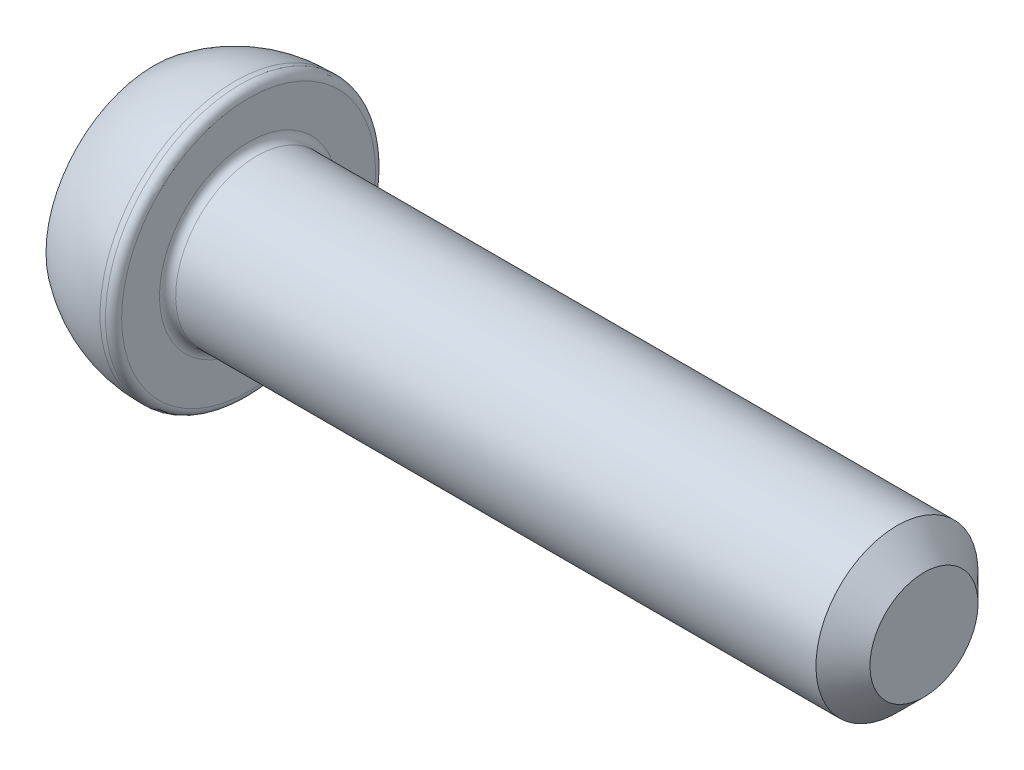
ISO-10303-21;
HEADER;
FILE_DESCRIPTION(('STEP AP214'),'2;1');
FILE_NAME('part.step','',(''),(''),'','','');
FILE_SCHEMA(('AUTOMOTIVE_DESIGN { 1 0 10303 214 1 1 1 1 }'));
ENDSEC;
DATA;
#1=APPLICATION_CONTEXT('core data for automotive mechanical design processes');
#2=APPLICATION_PROTOCOL_DEFINITION('international standard','automotive_design',2000,#1);
#3=PRODUCT_CONTEXT('',#1,'mechanical');
#4=PRODUCT('Part','Part','',(#3));
#5=PRODUCT_RELATED_PRODUCT_CATEGORY('part','',(#4));
#6=PRODUCT_DEFINITION_FORMATION('','',#4);
#7=PRODUCT_DEFINITION_CONTEXT('part definition',#1,'design');
#8=PRODUCT_DEFINITION('design','',#6,#7);
#9=PRODUCT_DEFINITION_SHAPE('','',#8);
#10=(LENGTH_UNIT() NAMED_UNIT(*) SI_UNIT(.MILLI.,.METRE.));
#11=(NAMED_UNIT(*) PLANE_ANGLE_UNIT() SI_UNIT($,.RADIAN.));
#12=(NAMED_UNIT(*) SI_UNIT($,.STERADIAN.) SOLID_ANGLE_UNIT());
#13=UNCERTAINTY_MEASURE_WITH_UNIT(LENGTH_MEASURE(1.E-05),#10,'distance_accuracy_value','');
#14=(GEOMETRIC_REPRESENTATION_CONTEXT(3) GLOBAL_UNCERTAINTY_ASSIGNED_CONTEXT((#13)) GLOBAL_UNIT_ASSIGNED_CONTEXT((#10,
#11,#12)) REPRESENTATION_CONTEXT('',''));
#15=CARTESIAN_POINT('',(0.,0.,0.));
#16=DIRECTION('',(0.,0.,1.));
#17=DIRECTION('',(1.,0.,0.));
#18=AXIS2_PLACEMENT_3D('',#15,#16,#17);
#19=CARTESIAN_POINT('',(0.,0.,0.));
#20=DIRECTION('',(-1.,0.,0.));
#21=DIRECTION('',(0.,-1.,0.));
#22=AXIS2_PLACEMENT_3D('',#19,#20,#21);
#23=PLANE('',#22);
#24=DIRECTION('',(0.,0.866025403784438,-0.5));
#25=VECTOR('',#24,1.);
#26=CARTESIAN_POINT('',(0.,0.,2.3094010767585));
#27=LINE('',#26,#25);
#28=CARTESIAN_POINT('',(0.,0.,2.3094010767585));
#29=VERTEX_POINT('',#28);
#30=CARTESIAN_POINT('',(0.,2.,1.15470053837925));
#31=VERTEX_POINT('',#30);
#32=EDGE_CURVE('E54',#29,#31,#27,.T.);
#33=ORIENTED_EDGE('',*,*,#32,.F.);
#34=DIRECTION('',(0.,0.866025403784439,0.5));
#35=VECTOR('',#34,1.);
#36=CARTESIAN_POINT('',(0.,-2.,1.15470053837925));
#37=LINE('',#36,#35);
#38=CARTESIAN_POINT('',(0.,-2.,1.15470053837925));
#39=VERTEX_POINT('',#38);
#40=EDGE_CURVE('E137',#39,#29,#37,.T.);
#41=ORIENTED_EDGE('',*,*,#40,.F.);
#42=DIRECTION('',(0.,0.,1.));
#43=VECTOR('',#42,1.);
#44=CARTESIAN_POINT('',(0.,-2.,-1.15470053837925));
#45=LINE('',#44,#43);
#46=CARTESIAN_POINT('',(0.,-2.,-1.15470053837925));
#47=VERTEX_POINT('',#46);
#48=EDGE_CURVE('E135',#47,#39,#45,.T.);
#49=ORIENTED_EDGE('',*,*,#48,.F.);
#50=DIRECTION('',(0.,-0.866025403784439,0.5));
#51=VECTOR('',#50,1.);
#52=CARTESIAN_POINT('',(0.,0.,-2.3094010767585));
#53=LINE('',#52,#51);
#54=CARTESIAN_POINT('',(0.,0.,-2.3094010767585));
#55=VERTEX_POINT('',#54);
#56=EDGE_CURVE('E102',#55,#47,#53,.T.);
#57=ORIENTED_EDGE('',*,*,#56,.F.);
#58=DIRECTION('',(0.,-0.866025403784439,-0.5));
#59=VECTOR('',#58,1.);
#60=CARTESIAN_POINT('',(0.,2.,-1.15470053837925));
#61=LINE('',#60,#59);
#62=CARTESIAN_POINT('',(0.,2.,-1.15470053837925));
#63=VERTEX_POINT('',#62);
#64=EDGE_CURVE('E131',#63,#55,#61,.T.);
#65=ORIENTED_EDGE('',*,*,#64,.F.);
#66=DIRECTION('',(0.,0.,-1.));
#67=VECTOR('',#66,1.);
#68=CARTESIAN_POINT('',(0.,2.,1.15470053837925));
#69=LINE('',#68,#67);
#70=EDGE_CURVE('E128',#31,#63,#69,.T.);
#71=ORIENTED_EDGE('',*,*,#70,.F.);
#72=EDGE_LOOP('',(#33,#41,#49,#57,#65,#71));
#73=FACE_BOUND('',#72,.T.);
#74=CARTESIAN_POINT('',(0.,0.,0.));
#75=DIRECTION('',(1.,0.,0.));
#76=DIRECTION('',(0.,1.,0.));
#77=AXIS2_PLACEMENT_3D('',#74,#75,#76);
#78=CIRCLE('',#77,4.);
#79=CARTESIAN_POINT('',(0.,4.,0.));
#80=VERTEX_POINT('',#79);
#81=EDGE_CURVE('E149',#80,#80,#78,.T.);
#82=ORIENTED_EDGE('',*,*,#81,.F.);
#83=EDGE_LOOP('',(#82));
#84=FACE_BOUND('',#83,.T.);
#85=ADVANCED_FACE('F38',(#73,#84),#23,.T.);
#86=CARTESIAN_POINT('',(3.,0.,0.));
#87=DIRECTION('',(1.,0.,0.));
#88=DIRECTION('',(0.,1.,0.));
#89=AXIS2_PLACEMENT_3D('',#86,#87,#88);
#90=SPHERICAL_SURFACE('',#89,5.);
#91=ORIENTED_EDGE('',*,*,#81,.T.);
#92=EDGE_LOOP('',(#91));
#93=FACE_BOUND('',#92,.T.);
#94=CARTESIAN_POINT('',(3.,0.,0.));
#95=DIRECTION('',(1.,0.,0.));
#96=DIRECTION('',(0.,1.,0.));
#97=AXIS2_PLACEMENT_3D('',#94,#95,#96);
#98=CIRCLE('',#97,5.);
#99=CARTESIAN_POINT('',(3.,5.,0.));
#100=VERTEX_POINT('',#99);
#101=EDGE_CURVE('E141',#100,#100,#98,.T.);
#102=ORIENTED_EDGE('',*,*,#101,.F.);
#103=EDGE_LOOP('',(#102));
#104=FACE_BOUND('',#103,.T.);
#105=ADVANCED_FACE('F178',(#93,#104),#90,.T.);
#106=CARTESIAN_POINT('',(28.5,0.,0.));
#107=DIRECTION('',(1.,0.,0.));
#108=DIRECTION('',(0.,1.,0.));
#109=AXIS2_PLACEMENT_3D('',#106,#107,#108);
#110=CYLINDRICAL_SURFACE('',#109,5.);
#111=CARTESIAN_POINT('',(3.2,0.,0.));
#112=DIRECTION('',(1.,0.,0.));
#113=DIRECTION('',(0.,1.,0.));
#114=AXIS2_PLACEMENT_3D('',#111,#112,#113);
#115=CIRCLE('',#114,5.);
#116=CARTESIAN_POINT('',(3.2,5.,0.));
#117=VERTEX_POINT('',#116);
#118=EDGE_CURVE('E161',#117,#117,#115,.F.);
#119=ORIENTED_EDGE('',*,*,#118,.T.);
#120=EDGE_LOOP('',(#119));
#121=FACE_BOUND('',#120,.T.);
#122=ORIENTED_EDGE('',*,*,#101,.T.);
#123=EDGE_LOOP('',(#122));
#124=FACE_BOUND('',#123,.T.);
#125=ADVANCED_FACE('F184',(#121,#124),#110,.T.);
#126=CARTESIAN_POINT('',(3.5,5.,0.));
#127=DIRECTION('',(1.,0.,0.));
#128=DIRECTION('',(0.,1.,0.));
#129=AXIS2_PLACEMENT_3D('',#126,#127,#128);
#130=PLANE('',#129);
#131=CARTESIAN_POINT('',(3.5,0.,0.));
#132=DIRECTION('',(1.,0.,0.));
#133=DIRECTION('',(0.,1.,0.));
#134=AXIS2_PLACEMENT_3D('',#131,#132,#133);
#135=CIRCLE('',#134,3.3);
#136=CARTESIAN_POINT('',(3.5,3.3,0.));
#137=VERTEX_POINT('',#136);
#138=EDGE_CURVE('E158',#137,#137,#135,.F.);
#139=ORIENTED_EDGE('',*,*,#138,.T.);
#140=EDGE_LOOP('',(#139));
#141=FACE_BOUND('',#140,.T.);
#142=CARTESIAN_POINT('',(3.5,0.,0.));
#143=DIRECTION('',(1.,0.,0.));
#144=DIRECTION('',(0.,1.,0.));
#145=AXIS2_PLACEMENT_3D('',#142,#143,#144);
#146=CIRCLE('',#145,4.7);
#147=CARTESIAN_POINT('',(3.5,4.7,0.));
#148=VERTEX_POINT('',#147);
#149=EDGE_CURVE('E155',#148,#148,#146,.T.);
#150=ORIENTED_EDGE('',*,*,#149,.T.);
#151=EDGE_LOOP('',(#150));
#152=FACE_BOUND('',#151,.T.);
#153=ADVANCED_FACE('F203',(#141,#152),#130,.T.);
#154=CARTESIAN_POINT('',(28.5,0.,0.));
#155=DIRECTION('',(1.,0.,0.));
#156=DIRECTION('',(0.,1.,0.));
#157=AXIS2_PLACEMENT_3D('',#154,#155,#156);
#158=CYLINDRICAL_SURFACE('',#157,3.);
#159=CARTESIAN_POINT('',(27.5,0.,0.));
#160=DIRECTION('',(1.,0.,0.));
#161=DIRECTION('',(0.,1.,0.));
#162=AXIS2_PLACEMENT_3D('',#159,#160,#161);
#163=CIRCLE('',#162,3.);
#164=CARTESIAN_POINT('',(27.5,3.,0.));
#165=VERTEX_POINT('',#164);
#166=EDGE_CURVE('E11',#165,#165,#163,.F.);
#167=ORIENTED_EDGE('',*,*,#166,.T.);
#168=EDGE_LOOP('',(#167));
#169=FACE_BOUND('',#168,.T.);
#170=CARTESIAN_POINT('',(3.8,0.,0.));
#171=DIRECTION('',(1.,0.,0.));
#172=DIRECTION('',(0.,1.,0.));
#173=AXIS2_PLACEMENT_3D('',#170,#171,#172);
#174=CIRCLE('',#173,3.);
#175=CARTESIAN_POINT('',(3.8,3.,0.));
#176=VERTEX_POINT('',#175);
#177=EDGE_CURVE('E152',#176,#176,#174,.T.);
#178=ORIENTED_EDGE('',*,*,#177,.T.);
#179=EDGE_LOOP('',(#178));
#180=FACE_BOUND('',#179,.T.);
#181=ADVANCED_FACE('F201',(#169,#180),#158,.T.);
#182=CARTESIAN_POINT('',(28.5,3.,0.));
#183=DIRECTION('',(1.,0.,0.));
#184=DIRECTION('',(0.,1.,0.));
#185=AXIS2_PLACEMENT_3D('',#182,#183,#184);
#186=PLANE('',#185);
#187=CARTESIAN_POINT('',(28.5,0.,0.));
#188=DIRECTION('',(1.,0.,0.));
#189=DIRECTION('',(0.,1.,0.));
#190=AXIS2_PLACEMENT_3D('',#187,#188,#189);
#191=CIRCLE('',#190,1.99999999999999);
#192=CARTESIAN_POINT('',(28.5,2.,0.));
#193=VERTEX_POINT('',#192);
#194=EDGE_CURVE('E47',#193,#193,#191,.T.);
#195=ORIENTED_EDGE('',*,*,#194,.T.);
#196=EDGE_LOOP('',(#195));
#197=FACE_BOUND('',#196,.T.);
#198=ADVANCED_FACE('F166',(#197),#186,.T.);
#199=CARTESIAN_POINT('',(2.,0.,2.3094010767585));
#200=DIRECTION('',(0.,0.5,0.866025403784439));
#201=DIRECTION('',(0.,-0.866025403784438,0.5));
#202=AXIS2_PLACEMENT_3D('',#199,#200,#201);
#203=PLANE('',#202);
#204=ORIENTED_EDGE('',*,*,#32,.T.);
#205=DIRECTION('',(-1.,0.,0.));
#206=VECTOR('',#205,1.);
#207=CARTESIAN_POINT('',(2.,2.,1.15470053837925));
#208=LINE('',#207,#206);
#209=CARTESIAN_POINT('',(2.,2.,1.15470053837925));
#210=VERTEX_POINT('',#209);
#211=EDGE_CURVE('E84',#210,#31,#208,.T.);
#212=ORIENTED_EDGE('',*,*,#211,.F.);
#213=DIRECTION('',(0.,0.866025403784438,-0.5));
#214=VECTOR('',#213,1.);
#215=CARTESIAN_POINT('',(2.,0.,2.3094010767585));
#216=LINE('',#215,#214);
#217=CARTESIAN_POINT('',(2.,0.,2.3094010767585));
#218=VERTEX_POINT('',#217);
#219=EDGE_CURVE('E139',#218,#210,#216,.T.);
#220=ORIENTED_EDGE('',*,*,#219,.F.);
#221=DIRECTION('',(-1.,0.,0.));
#222=VECTOR('',#221,1.);
#223=CARTESIAN_POINT('',(2.,0.,2.3094010767585));
#224=LINE('',#223,#222);
#225=EDGE_CURVE('E62',#218,#29,#224,.T.);
#226=ORIENTED_EDGE('',*,*,#225,.T.);
#227=EDGE_LOOP('',(#204,#212,#220,#226));
#228=FACE_BOUND('',#227,.T.);
#229=ADVANCED_FACE('F210',(#228),#203,.F.);
#230=CARTESIAN_POINT('',(2.,-2.,1.15470053837925));
#231=DIRECTION('',(0.,-0.5,0.866025403784439));
#232=DIRECTION('',(0.,-0.866025403784439,-0.5));
#233=AXIS2_PLACEMENT_3D('',#230,#231,#232);
#234=PLANE('',#233);
#235=ORIENTED_EDGE('',*,*,#40,.T.);
#236=ORIENTED_EDGE('',*,*,#225,.F.);
#237=DIRECTION('',(0.,0.866025403784439,0.5));
#238=VECTOR('',#237,1.);
#239=CARTESIAN_POINT('',(2.,-2.,1.15470053837925));
#240=LINE('',#239,#238);
#241=CARTESIAN_POINT('',(2.,-2.,1.15470053837925));
#242=VERTEX_POINT('',#241);
#243=EDGE_CURVE('E114',#242,#218,#240,.T.);
#244=ORIENTED_EDGE('',*,*,#243,.F.);
#245=DIRECTION('',(-1.,0.,0.));
#246=VECTOR('',#245,1.);
#247=CARTESIAN_POINT('',(2.,-2.,1.15470053837925));
#248=LINE('',#247,#246);
#249=EDGE_CURVE('E106',#242,#39,#248,.T.);
#250=ORIENTED_EDGE('',*,*,#249,.T.);
#251=EDGE_LOOP('',(#235,#236,#244,#250));
#252=FACE_BOUND('',#251,.T.);
#253=ADVANCED_FACE('F269',(#252),#234,.F.);
#254=CARTESIAN_POINT('',(2.,-2.,-1.15470053837925));
#255=DIRECTION('',(0.,-1.,0.));
#256=DIRECTION('',(0.,0.,-1.));
#257=AXIS2_PLACEMENT_3D('',#254,#255,#256);
#258=PLANE('',#257);
#259=ORIENTED_EDGE('',*,*,#48,.T.);
#260=ORIENTED_EDGE('',*,*,#249,.F.);
#261=DIRECTION('',(0.,0.,1.));
#262=VECTOR('',#261,1.);
#263=CARTESIAN_POINT('',(2.,-2.,-1.15470053837925));
#264=LINE('',#263,#262);
#265=CARTESIAN_POINT('',(2.,-2.,-1.15470053837925));
#266=VERTEX_POINT('',#265);
#267=EDGE_CURVE('E110',#266,#242,#264,.T.);
#268=ORIENTED_EDGE('',*,*,#267,.F.);
#269=DIRECTION('',(-1.,0.,0.));
#270=VECTOR('',#269,1.);
#271=CARTESIAN_POINT('',(2.,-2.,-1.15470053837925));
#272=LINE('',#271,#270);
#273=EDGE_CURVE('E95',#266,#47,#272,.T.);
#274=ORIENTED_EDGE('',*,*,#273,.T.);
#275=EDGE_LOOP('',(#259,#260,#268,#274));
#276=FACE_BOUND('',#275,.T.);
#277=ADVANCED_FACE('F111',(#276),#258,.F.);
#278=CARTESIAN_POINT('',(2.,0.,-2.3094010767585));
#279=DIRECTION('',(0.,-0.5,-0.866025403784439));
#280=DIRECTION('',(0.,0.866025403784439,-0.5));
#281=AXIS2_PLACEMENT_3D('',#278,#279,#280);
#282=PLANE('',#281);
#283=ORIENTED_EDGE('',*,*,#56,.T.);
#284=ORIENTED_EDGE('',*,*,#273,.F.);
#285=DIRECTION('',(0.,-0.866025403784439,0.5));
#286=VECTOR('',#285,1.);
#287=CARTESIAN_POINT('',(2.,0.,-2.3094010767585));
#288=LINE('',#287,#286);
#289=CARTESIAN_POINT('',(2.,0.,-2.3094010767585));
#290=VERTEX_POINT('',#289);
#291=EDGE_CURVE('E99',#290,#266,#288,.T.);
#292=ORIENTED_EDGE('',*,*,#291,.F.);
#293=DIRECTION('',(-1.,0.,0.));
#294=VECTOR('',#293,1.);
#295=CARTESIAN_POINT('',(2.,0.,-2.3094010767585));
#296=LINE('',#295,#294);
#297=EDGE_CURVE('E107',#290,#55,#296,.T.);
#298=ORIENTED_EDGE('',*,*,#297,.T.);
#299=EDGE_LOOP('',(#283,#284,#292,#298));
#300=FACE_BOUND('',#299,.T.);
#301=ADVANCED_FACE('F97',(#300),#282,.F.);
#302=CARTESIAN_POINT('',(2.,2.,-1.15470053837925));
#303=DIRECTION('',(0.,0.5,-0.866025403784439));
#304=DIRECTION('',(0.,0.866025403784439,0.5));
#305=AXIS2_PLACEMENT_3D('',#302,#303,#304);
#306=PLANE('',#305);
#307=ORIENTED_EDGE('',*,*,#64,.T.);
#308=ORIENTED_EDGE('',*,*,#297,.F.);
#309=DIRECTION('',(0.,-0.866025403784439,-0.5));
#310=VECTOR('',#309,1.);
#311=CARTESIAN_POINT('',(2.,2.,-1.15470053837925));
#312=LINE('',#311,#310);
#313=CARTESIAN_POINT('',(2.,2.,-1.15470053837925));
#314=VERTEX_POINT('',#313);
#315=EDGE_CURVE('E120',#314,#290,#312,.T.);
#316=ORIENTED_EDGE('',*,*,#315,.F.);
#317=DIRECTION('',(-1.,0.,0.));
#318=VECTOR('',#317,1.);
#319=CARTESIAN_POINT('',(2.,2.,-1.15470053837925));
#320=LINE('',#319,#318);
#321=EDGE_CURVE('E144',#314,#63,#320,.T.);
#322=ORIENTED_EDGE('',*,*,#321,.T.);
#323=EDGE_LOOP('',(#307,#308,#316,#322));
#324=FACE_BOUND('',#323,.T.);
#325=ADVANCED_FACE('F286',(#324),#306,.F.);
#326=CARTESIAN_POINT('',(2.,2.,1.15470053837925));
#327=DIRECTION('',(0.,1.,0.));
#328=DIRECTION('',(0.,0.,1.));
#329=AXIS2_PLACEMENT_3D('',#326,#327,#328);
#330=PLANE('',#329);
#331=ORIENTED_EDGE('',*,*,#70,.T.);
#332=ORIENTED_EDGE('',*,*,#321,.F.);
#333=DIRECTION('',(0.,0.,-1.));
#334=VECTOR('',#333,1.);
#335=CARTESIAN_POINT('',(2.,2.,1.15470053837925));
#336=LINE('',#335,#334);
#337=EDGE_CURVE('E122',#210,#314,#336,.T.);
#338=ORIENTED_EDGE('',*,*,#337,.F.);
#339=ORIENTED_EDGE('',*,*,#211,.T.);
#340=EDGE_LOOP('',(#331,#332,#338,#339));
#341=FACE_BOUND('',#340,.T.);
#342=ADVANCED_FACE('F195',(#341),#330,.F.);
#343=CARTESIAN_POINT('',(2.,0.,0.));
#344=DIRECTION('',(-1.,0.,0.));
#345=DIRECTION('',(0.,0.,1.));
#346=AXIS2_PLACEMENT_3D('',#343,#344,#345);
#347=PLANE('',#346);
#348=ORIENTED_EDGE('',*,*,#219,.T.);
#349=ORIENTED_EDGE('',*,*,#337,.T.);
#350=ORIENTED_EDGE('',*,*,#315,.T.);
#351=ORIENTED_EDGE('',*,*,#291,.T.);
#352=ORIENTED_EDGE('',*,*,#267,.T.);
#353=ORIENTED_EDGE('',*,*,#243,.T.);
#354=EDGE_LOOP('',(#348,#349,#350,#351,#352,#353));
#355=FACE_BOUND('',#354,.T.);
#356=ADVANCED_FACE('F117',(#355),#347,.T.);
#357=CARTESIAN_POINT('',(3.8,0.,0.));
#358=DIRECTION('',(1.,0.,0.));
#359=DIRECTION('',(0.,1.,0.));
#360=AXIS2_PLACEMENT_3D('',#357,#358,#359);
#361=TOROIDAL_SURFACE('',#360,3.3,0.3);
#362=ORIENTED_EDGE('',*,*,#138,.F.);
#363=EDGE_LOOP('',(#362));
#364=FACE_BOUND('',#363,.T.);
#365=ORIENTED_EDGE('',*,*,#177,.F.);
#366=EDGE_LOOP('',(#365));
#367=FACE_BOUND('',#366,.T.);
#368=ADVANCED_FACE('F174',(#364,#367),#361,.F.);
#369=CARTESIAN_POINT('',(3.2,0.,0.));
#370=DIRECTION('',(1.,0.,0.));
#371=DIRECTION('',(0.,1.,0.));
#372=AXIS2_PLACEMENT_3D('',#369,#370,#371);
#373=TOROIDAL_SURFACE('',#372,4.7,0.3);
#374=ORIENTED_EDGE('',*,*,#118,.F.);
#375=EDGE_LOOP('',(#374));
#376=FACE_BOUND('',#375,.T.);
#377=ORIENTED_EDGE('',*,*,#149,.F.);
#378=EDGE_LOOP('',(#377));
#379=FACE_BOUND('',#378,.T.);
#380=ADVANCED_FACE('F169',(#376,#379),#373,.T.);
#381=CARTESIAN_POINT('',(28.5,0.,0.));
#382=DIRECTION('',(-1.,0.,0.));
#383=DIRECTION('',(0.,-1.,0.));
#384=AXIS2_PLACEMENT_3D('',#381,#382,#383);
#385=CONICAL_SURFACE('',#384,1.99999999999999,0.785398163397447);
#386=ORIENTED_EDGE('',*,*,#166,.F.);
#387=EDGE_LOOP('',(#386));
#388=FACE_BOUND('',#387,.T.);
#389=ORIENTED_EDGE('',*,*,#194,.F.);
#390=EDGE_LOOP('',(#389));
#391=FACE_BOUND('',#390,.T.);
#392=ADVANCED_FACE('F41',(#388,#391),#385,.T.);
#393=CLOSED_SHELL('',(#85,#105,#125,#153,#181,#198,#229,#253,#277,#301,#325,#342,#356,#368,#380,#392));
#394=MANIFOLD_SOLID_BREP('B2',#393);
#395=ADVANCED_BREP_SHAPE_REPRESENTATION('',(#18,#394),#14);
#396=SHAPE_DEFINITION_REPRESENTATION(#9,#395);
ENDSEC;
END-ISO-10303-21;
